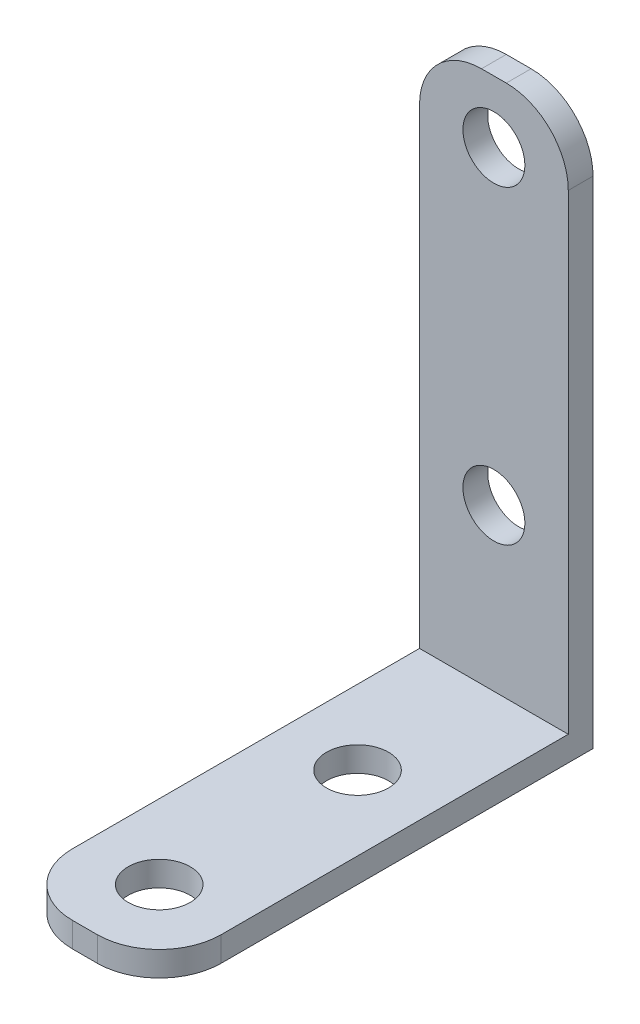
ISO-10303-21;
HEADER;
FILE_DESCRIPTION(('STEP AP214'),'2;1');
FILE_NAME('part.step','',(''),(''),'','','');
FILE_SCHEMA(('AUTOMOTIVE_DESIGN { 1 0 10303 214 1 1 1 1 }'));
ENDSEC;
DATA;
#1=APPLICATION_CONTEXT('core data for automotive mechanical design processes');
#2=APPLICATION_PROTOCOL_DEFINITION('international standard','automotive_design',2000,#1);
#3=PRODUCT_CONTEXT('',#1,'mechanical');
#4=PRODUCT('Part','Part','',(#3));
#5=PRODUCT_RELATED_PRODUCT_CATEGORY('part','',(#4));
#6=PRODUCT_DEFINITION_FORMATION('','',#4);
#7=PRODUCT_DEFINITION_CONTEXT('part definition',#1,'design');
#8=PRODUCT_DEFINITION('design','',#6,#7);
#9=PRODUCT_DEFINITION_SHAPE('','',#8);
#10=(LENGTH_UNIT() NAMED_UNIT(*) SI_UNIT(.MILLI.,.METRE.));
#11=(NAMED_UNIT(*) PLANE_ANGLE_UNIT() SI_UNIT($,.RADIAN.));
#12=(NAMED_UNIT(*) SI_UNIT($,.STERADIAN.) SOLID_ANGLE_UNIT());
#13=UNCERTAINTY_MEASURE_WITH_UNIT(LENGTH_MEASURE(1.E-05),#10,'distance_accuracy_value','');
#14=(GEOMETRIC_REPRESENTATION_CONTEXT(3) GLOBAL_UNCERTAINTY_ASSIGNED_CONTEXT((#13)) GLOBAL_UNIT_ASSIGNED_CONTEXT((#10,
#11,#12)) REPRESENTATION_CONTEXT('',''));
#15=CARTESIAN_POINT('',(0.,0.,0.));
#16=DIRECTION('',(0.,0.,1.));
#17=DIRECTION('',(1.,0.,0.));
#18=AXIS2_PLACEMENT_3D('',#15,#16,#17);
#19=CARTESIAN_POINT('',(0.,0.,2.));
#20=DIRECTION('',(0.,0.,1.));
#21=DIRECTION('',(1.,0.,0.));
#22=AXIS2_PLACEMENT_3D('',#19,#20,#21);
#23=PLANE('',#22);
#24=DIRECTION('',(-1.,0.,0.));
#25=VECTOR('',#24,1.);
#26=CARTESIAN_POINT('',(-6.,-20.5,2.));
#27=LINE('',#26,#25);
#28=CARTESIAN_POINT('',(6.,-20.5,2.));
#29=VERTEX_POINT('',#28);
#30=CARTESIAN_POINT('',(-6.,-20.5,2.));
#31=VERTEX_POINT('',#30);
#32=EDGE_CURVE('E126',#29,#31,#27,.T.);
#33=ORIENTED_EDGE('',*,*,#32,.F.);
#34=DIRECTION('',(0.,1.,0.));
#35=VECTOR('',#34,1.);
#36=CARTESIAN_POINT('',(6.,-22.5,2.));
#37=LINE('',#36,#35);
#38=CARTESIAN_POINT('',(6.,17.5,2.));
#39=VERTEX_POINT('',#38);
#40=EDGE_CURVE('E131',#29,#39,#37,.T.);
#41=ORIENTED_EDGE('',*,*,#40,.T.);
#42=CARTESIAN_POINT('',(1.,17.5,2.));
#43=DIRECTION('',(0.,0.,1.));
#44=DIRECTION('',(1.,0.,0.));
#45=AXIS2_PLACEMENT_3D('',#42,#43,#44);
#46=CIRCLE('',#45,5.);
#47=CARTESIAN_POINT('',(1.,22.5,2.));
#48=VERTEX_POINT('',#47);
#49=EDGE_CURVE('E189',#39,#48,#46,.T.);
#50=ORIENTED_EDGE('',*,*,#49,.T.);
#51=DIRECTION('',(-1.,0.,0.));
#52=VECTOR('',#51,1.);
#53=CARTESIAN_POINT('',(6.,22.5,2.));
#54=LINE('',#53,#52);
#55=CARTESIAN_POINT('',(-0.999999999999999,22.5,2.));
#56=VERTEX_POINT('',#55);
#57=EDGE_CURVE('E160',#48,#56,#54,.T.);
#58=ORIENTED_EDGE('',*,*,#57,.T.);
#59=CARTESIAN_POINT('',(-0.999999999999999,17.5,2.));
#60=DIRECTION('',(0.,0.,1.));
#61=DIRECTION('',(1.,0.,0.));
#62=AXIS2_PLACEMENT_3D('',#59,#60,#61);
#63=CIRCLE('',#62,5.);
#64=CARTESIAN_POINT('',(-6.,17.5,2.));
#65=VERTEX_POINT('',#64);
#66=EDGE_CURVE('E130',#56,#65,#63,.T.);
#67=ORIENTED_EDGE('',*,*,#66,.T.);
#68=DIRECTION('',(0.,-1.,0.));
#69=VECTOR('',#68,1.);
#70=CARTESIAN_POINT('',(-6.,-22.5,2.));
#71=LINE('',#70,#69);
#72=EDGE_CURVE('E116',#65,#31,#71,.T.);
#73=ORIENTED_EDGE('',*,*,#72,.T.);
#74=EDGE_LOOP('',(#33,#41,#50,#58,#67,#73));
#75=FACE_BOUND('',#74,.T.);
#76=CARTESIAN_POINT('',(0.,-7.50000000000001,2.));
#77=DIRECTION('',(0.,0.,1.));
#78=DIRECTION('',(1.,0.,0.));
#79=AXIS2_PLACEMENT_3D('',#76,#77,#78);
#80=CIRCLE('',#79,2.5);
#81=CARTESIAN_POINT('',(2.5,-7.50000000000001,2.));
#82=VERTEX_POINT('',#81);
#83=EDGE_CURVE('E153',#82,#82,#80,.T.);
#84=ORIENTED_EDGE('',*,*,#83,.F.);
#85=EDGE_LOOP('',(#84));
#86=FACE_BOUND('',#85,.T.);
#87=CARTESIAN_POINT('',(0.,17.5,2.));
#88=DIRECTION('',(0.,0.,1.));
#89=DIRECTION('',(1.,0.,0.));
#90=AXIS2_PLACEMENT_3D('',#87,#88,#89);
#91=CIRCLE('',#90,2.5);
#92=CARTESIAN_POINT('',(2.5,17.5,2.));
#93=VERTEX_POINT('',#92);
#94=EDGE_CURVE('E147',#93,#93,#91,.T.);
#95=ORIENTED_EDGE('',*,*,#94,.F.);
#96=EDGE_LOOP('',(#95));
#97=FACE_BOUND('',#96,.T.);
#98=ADVANCED_FACE('F37',(#75,#86,#97),#23,.T.);
#99=CARTESIAN_POINT('',(0.,0.,0.));
#100=DIRECTION('',(0.,0.,1.));
#101=DIRECTION('',(1.,0.,0.));
#102=AXIS2_PLACEMENT_3D('',#99,#100,#101);
#103=PLANE('',#102);
#104=DIRECTION('',(-1.,0.,0.));
#105=VECTOR('',#104,1.);
#106=CARTESIAN_POINT('',(6.,22.5,0.));
#107=LINE('',#106,#105);
#108=CARTESIAN_POINT('',(1.,22.5,0.));
#109=VERTEX_POINT('',#108);
#110=CARTESIAN_POINT('',(-0.999999999999999,22.5,0.));
#111=VERTEX_POINT('',#110);
#112=EDGE_CURVE('E132',#109,#111,#107,.T.);
#113=ORIENTED_EDGE('',*,*,#112,.F.);
#114=CARTESIAN_POINT('',(1.,17.5,0.));
#115=DIRECTION('',(0.,0.,1.));
#116=DIRECTION('',(1.,0.,0.));
#117=AXIS2_PLACEMENT_3D('',#114,#115,#116);
#118=CIRCLE('',#117,5.);
#119=CARTESIAN_POINT('',(6.,17.5,0.));
#120=VERTEX_POINT('',#119);
#121=EDGE_CURVE('E183',#109,#120,#118,.F.);
#122=ORIENTED_EDGE('',*,*,#121,.T.);
#123=DIRECTION('',(0.,1.,0.));
#124=VECTOR('',#123,1.);
#125=CARTESIAN_POINT('',(6.,-22.5,0.));
#126=LINE('',#125,#124);
#127=CARTESIAN_POINT('',(6.,-22.5,0.));
#128=VERTEX_POINT('',#127);
#129=EDGE_CURVE('E168',#128,#120,#126,.T.);
#130=ORIENTED_EDGE('',*,*,#129,.F.);
#131=DIRECTION('',(1.,0.,0.));
#132=VECTOR('',#131,1.);
#133=CARTESIAN_POINT('',(6.,-22.5,0.));
#134=LINE('',#133,#132);
#135=CARTESIAN_POINT('',(-6.,-22.5,0.));
#136=VERTEX_POINT('',#135);
#137=EDGE_CURVE('E165',#136,#128,#134,.T.);
#138=ORIENTED_EDGE('',*,*,#137,.F.);
#139=DIRECTION('',(0.,-1.,0.));
#140=VECTOR('',#139,1.);
#141=CARTESIAN_POINT('',(-6.,-22.5,0.));
#142=LINE('',#141,#140);
#143=CARTESIAN_POINT('',(-6.,17.5,0.));
#144=VERTEX_POINT('',#143);
#145=EDGE_CURVE('E156',#144,#136,#142,.T.);
#146=ORIENTED_EDGE('',*,*,#145,.F.);
#147=CARTESIAN_POINT('',(-0.999999999999999,17.5,0.));
#148=DIRECTION('',(0.,0.,1.));
#149=DIRECTION('',(1.,0.,0.));
#150=AXIS2_PLACEMENT_3D('',#147,#148,#149);
#151=CIRCLE('',#150,5.);
#152=EDGE_CURVE('E181',#144,#111,#151,.F.);
#153=ORIENTED_EDGE('',*,*,#152,.T.);
#154=EDGE_LOOP('',(#113,#122,#130,#138,#146,#153));
#155=FACE_BOUND('',#154,.T.);
#156=CARTESIAN_POINT('',(0.,-7.50000000000001,0.));
#157=DIRECTION('',(0.,0.,1.));
#158=DIRECTION('',(1.,0.,0.));
#159=AXIS2_PLACEMENT_3D('',#156,#157,#158);
#160=CIRCLE('',#159,2.5);
#161=CARTESIAN_POINT('',(2.5,-7.50000000000001,0.));
#162=VERTEX_POINT('',#161);
#163=EDGE_CURVE('E150',#162,#162,#160,.T.);
#164=ORIENTED_EDGE('',*,*,#163,.T.);
#165=EDGE_LOOP('',(#164));
#166=FACE_BOUND('',#165,.T.);
#167=CARTESIAN_POINT('',(0.,17.5,0.));
#168=DIRECTION('',(0.,0.,1.));
#169=DIRECTION('',(1.,0.,0.));
#170=AXIS2_PLACEMENT_3D('',#167,#168,#169);
#171=CIRCLE('',#170,2.5);
#172=CARTESIAN_POINT('',(2.5,17.5,0.));
#173=VERTEX_POINT('',#172);
#174=EDGE_CURVE('E146',#173,#173,#171,.T.);
#175=ORIENTED_EDGE('',*,*,#174,.T.);
#176=EDGE_LOOP('',(#175));
#177=FACE_BOUND('',#176,.T.);
#178=ADVANCED_FACE('F219',(#155,#166,#177),#103,.F.);
#179=CARTESIAN_POINT('',(-6.,-22.5,2.));
#180=DIRECTION('',(1.,0.,0.));
#181=DIRECTION('',(0.,0.,-1.));
#182=AXIS2_PLACEMENT_3D('',#179,#180,#181);
#183=PLANE('',#182);
#184=DIRECTION('',(0.,0.,-1.));
#185=VECTOR('',#184,1.);
#186=CARTESIAN_POINT('',(-6.,-22.5,2.));
#187=LINE('',#186,#185);
#188=CARTESIAN_POINT('',(-6.,-22.5,30.));
#189=VERTEX_POINT('',#188);
#190=EDGE_CURVE('E174',#189,#136,#187,.T.);
#191=ORIENTED_EDGE('',*,*,#190,.F.);
#192=DIRECTION('',(0.,-1.,0.));
#193=VECTOR('',#192,1.);
#194=CARTESIAN_POINT('',(-6.,-22.5,30.));
#195=LINE('',#194,#193);
#196=CARTESIAN_POINT('',(-6.,-20.5,30.));
#197=VERTEX_POINT('',#196);
#198=EDGE_CURVE('E60',#189,#197,#195,.F.);
#199=ORIENTED_EDGE('',*,*,#198,.T.);
#200=DIRECTION('',(0.,0.,-1.));
#201=VECTOR('',#200,1.);
#202=CARTESIAN_POINT('',(-6.,-20.5,35.));
#203=LINE('',#202,#201);
#204=EDGE_CURVE('E112',#197,#31,#203,.T.);
#205=ORIENTED_EDGE('',*,*,#204,.T.);
#206=ORIENTED_EDGE('',*,*,#72,.F.);
#207=DIRECTION('',(0.,0.,-1.));
#208=VECTOR('',#207,1.);
#209=CARTESIAN_POINT('',(-6.,17.5,2.));
#210=LINE('',#209,#208);
#211=EDGE_CURVE('E191',#65,#144,#210,.T.);
#212=ORIENTED_EDGE('',*,*,#211,.T.);
#213=ORIENTED_EDGE('',*,*,#145,.T.);
#214=EDGE_LOOP('',(#191,#199,#205,#206,#212,#213));
#215=FACE_BOUND('',#214,.T.);
#216=ADVANCED_FACE('F114',(#215),#183,.F.);
#217=CARTESIAN_POINT('',(6.,-22.5,2.));
#218=DIRECTION('',(0.,1.,0.));
#219=DIRECTION('',(0.,0.,1.));
#220=AXIS2_PLACEMENT_3D('',#217,#218,#219);
#221=PLANE('',#220);
#222=CARTESIAN_POINT('',(0.,-22.5,13.));
#223=DIRECTION('',(0.,1.,0.));
#224=DIRECTION('',(0.,0.,1.));
#225=AXIS2_PLACEMENT_3D('',#222,#223,#224);
#226=CIRCLE('',#225,2.5);
#227=CARTESIAN_POINT('',(0.,-22.5,15.5));
#228=VERTEX_POINT('',#227);
#229=EDGE_CURVE('E136',#228,#228,#226,.T.);
#230=ORIENTED_EDGE('',*,*,#229,.T.);
#231=EDGE_LOOP('',(#230));
#232=FACE_BOUND('',#231,.T.);
#233=CARTESIAN_POINT('',(0.,-22.5,29.));
#234=DIRECTION('',(0.,1.,0.));
#235=DIRECTION('',(0.,0.,1.));
#236=AXIS2_PLACEMENT_3D('',#233,#234,#235);
#237=CIRCLE('',#236,2.5);
#238=CARTESIAN_POINT('',(0.,-22.5,31.5));
#239=VERTEX_POINT('',#238);
#240=EDGE_CURVE('E141',#239,#239,#237,.T.);
#241=ORIENTED_EDGE('',*,*,#240,.T.);
#242=EDGE_LOOP('',(#241));
#243=FACE_BOUND('',#242,.T.);
#244=DIRECTION('',(1.,0.,0.));
#245=VECTOR('',#244,1.);
#246=CARTESIAN_POINT('',(-6.,-22.5,35.));
#247=LINE('',#246,#245);
#248=CARTESIAN_POINT('',(-0.999999999999999,-22.5,35.));
#249=VERTEX_POINT('',#248);
#250=CARTESIAN_POINT('',(1.,-22.5,35.));
#251=VERTEX_POINT('',#250);
#252=EDGE_CURVE('E135',#249,#251,#247,.T.);
#253=ORIENTED_EDGE('',*,*,#252,.F.);
#254=CARTESIAN_POINT('',(-0.999999999999999,-22.5,30.));
#255=DIRECTION('',(0.,1.,0.));
#256=DIRECTION('',(0.,0.,1.));
#257=AXIS2_PLACEMENT_3D('',#254,#255,#256);
#258=CIRCLE('',#257,5.);
#259=EDGE_CURVE('E201',#249,#189,#258,.F.);
#260=ORIENTED_EDGE('',*,*,#259,.T.);
#261=ORIENTED_EDGE('',*,*,#190,.T.);
#262=ORIENTED_EDGE('',*,*,#137,.T.);
#263=DIRECTION('',(0.,0.,-1.));
#264=VECTOR('',#263,1.);
#265=CARTESIAN_POINT('',(6.,-22.5,2.));
#266=LINE('',#265,#264);
#267=CARTESIAN_POINT('',(6.,-22.5,30.));
#268=VERTEX_POINT('',#267);
#269=EDGE_CURVE('E162',#268,#128,#266,.T.);
#270=ORIENTED_EDGE('',*,*,#269,.F.);
#271=CARTESIAN_POINT('',(1.,-22.5,30.));
#272=DIRECTION('',(0.,1.,0.));
#273=DIRECTION('',(0.,0.,1.));
#274=AXIS2_PLACEMENT_3D('',#271,#272,#273);
#275=CIRCLE('',#274,5.);
#276=EDGE_CURVE('E199',#268,#251,#275,.F.);
#277=ORIENTED_EDGE('',*,*,#276,.T.);
#278=EDGE_LOOP('',(#253,#260,#261,#262,#270,#277));
#279=FACE_BOUND('',#278,.T.);
#280=ADVANCED_FACE('F213',(#232,#243,#279),#221,.F.);
#281=CARTESIAN_POINT('',(6.,-22.5,2.));
#282=DIRECTION('',(-1.,0.,0.));
#283=DIRECTION('',(0.,0.,1.));
#284=AXIS2_PLACEMENT_3D('',#281,#282,#283);
#285=PLANE('',#284);
#286=DIRECTION('',(0.,0.,-1.));
#287=VECTOR('',#286,1.);
#288=CARTESIAN_POINT('',(6.,-20.5,35.));
#289=LINE('',#288,#287);
#290=CARTESIAN_POINT('',(6.,-20.5,30.));
#291=VERTEX_POINT('',#290);
#292=EDGE_CURVE('E120',#291,#29,#289,.T.);
#293=ORIENTED_EDGE('',*,*,#292,.F.);
#294=DIRECTION('',(0.,1.,0.));
#295=VECTOR('',#294,1.);
#296=CARTESIAN_POINT('',(6.,-22.5,30.));
#297=LINE('',#296,#295);
#298=EDGE_CURVE('E11',#291,#268,#297,.F.);
#299=ORIENTED_EDGE('',*,*,#298,.T.);
#300=ORIENTED_EDGE('',*,*,#269,.T.);
#301=ORIENTED_EDGE('',*,*,#129,.T.);
#302=DIRECTION('',(0.,0.,-1.));
#303=VECTOR('',#302,1.);
#304=CARTESIAN_POINT('',(6.,17.5,2.));
#305=LINE('',#304,#303);
#306=EDGE_CURVE('E185',#120,#39,#305,.F.);
#307=ORIENTED_EDGE('',*,*,#306,.T.);
#308=ORIENTED_EDGE('',*,*,#40,.F.);
#309=EDGE_LOOP('',(#293,#299,#300,#301,#307,#308));
#310=FACE_BOUND('',#309,.T.);
#311=ADVANCED_FACE('F226',(#310),#285,.F.);
#312=CARTESIAN_POINT('',(6.,22.5,2.));
#313=DIRECTION('',(0.,-1.,0.));
#314=DIRECTION('',(0.,0.,-1.));
#315=AXIS2_PLACEMENT_3D('',#312,#313,#314);
#316=PLANE('',#315);
#317=ORIENTED_EDGE('',*,*,#57,.F.);
#318=DIRECTION('',(0.,0.,-1.));
#319=VECTOR('',#318,1.);
#320=CARTESIAN_POINT('',(1.,22.5,2.));
#321=LINE('',#320,#319);
#322=EDGE_CURVE('E178',#48,#109,#321,.T.);
#323=ORIENTED_EDGE('',*,*,#322,.T.);
#324=ORIENTED_EDGE('',*,*,#112,.T.);
#325=DIRECTION('',(0.,0.,-1.));
#326=VECTOR('',#325,1.);
#327=CARTESIAN_POINT('',(-0.999999999999999,22.5,2.));
#328=LINE('',#327,#326);
#329=EDGE_CURVE('E176',#111,#56,#328,.F.);
#330=ORIENTED_EDGE('',*,*,#329,.T.);
#331=EDGE_LOOP('',(#317,#323,#324,#330));
#332=FACE_BOUND('',#331,.T.);
#333=ADVANCED_FACE('F233',(#332),#316,.F.);
#334=CARTESIAN_POINT('',(0.,-7.50000000000001,2.));
#335=DIRECTION('',(0.,0.,-1.));
#336=DIRECTION('',(-1.,0.,0.));
#337=AXIS2_PLACEMENT_3D('',#334,#335,#336);
#338=CYLINDRICAL_SURFACE('',#337,2.5);
#339=ORIENTED_EDGE('',*,*,#83,.T.);
#340=EDGE_LOOP('',(#339));
#341=FACE_BOUND('',#340,.T.);
#342=ORIENTED_EDGE('',*,*,#163,.F.);
#343=EDGE_LOOP('',(#342));
#344=FACE_BOUND('',#343,.T.);
#345=ADVANCED_FACE('F255',(#341,#344),#338,.F.);
#346=CARTESIAN_POINT('',(0.,17.5,2.));
#347=DIRECTION('',(0.,0.,-1.));
#348=DIRECTION('',(-1.,0.,0.));
#349=AXIS2_PLACEMENT_3D('',#346,#347,#348);
#350=CYLINDRICAL_SURFACE('',#349,2.5);
#351=ORIENTED_EDGE('',*,*,#94,.T.);
#352=EDGE_LOOP('',(#351));
#353=FACE_BOUND('',#352,.T.);
#354=ORIENTED_EDGE('',*,*,#174,.F.);
#355=EDGE_LOOP('',(#354));
#356=FACE_BOUND('',#355,.T.);
#357=ADVANCED_FACE('F246',(#353,#356),#350,.F.);
#358=CARTESIAN_POINT('',(1.,17.5,2.));
#359=DIRECTION('',(0.,0.,-1.));
#360=DIRECTION('',(-1.,0.,0.));
#361=AXIS2_PLACEMENT_3D('',#358,#359,#360);
#362=CYLINDRICAL_SURFACE('',#361,5.);
#363=ORIENTED_EDGE('',*,*,#49,.F.);
#364=ORIENTED_EDGE('',*,*,#306,.F.);
#365=ORIENTED_EDGE('',*,*,#121,.F.);
#366=ORIENTED_EDGE('',*,*,#322,.F.);
#367=EDGE_LOOP('',(#363,#364,#365,#366));
#368=FACE_BOUND('',#367,.T.);
#369=ADVANCED_FACE('F235',(#368),#362,.T.);
#370=CARTESIAN_POINT('',(-0.999999999999999,17.5,2.));
#371=DIRECTION('',(0.,0.,-1.));
#372=DIRECTION('',(-1.,0.,0.));
#373=AXIS2_PLACEMENT_3D('',#370,#371,#372);
#374=CYLINDRICAL_SURFACE('',#373,5.);
#375=ORIENTED_EDGE('',*,*,#66,.F.);
#376=ORIENTED_EDGE('',*,*,#329,.F.);
#377=ORIENTED_EDGE('',*,*,#152,.F.);
#378=ORIENTED_EDGE('',*,*,#211,.F.);
#379=EDGE_LOOP('',(#375,#376,#377,#378));
#380=FACE_BOUND('',#379,.T.);
#381=ADVANCED_FACE('F237',(#380),#374,.T.);
#382=CARTESIAN_POINT('',(-6.,-20.5,35.));
#383=DIRECTION('',(0.,-1.,0.));
#384=DIRECTION('',(0.,0.,-1.));
#385=AXIS2_PLACEMENT_3D('',#382,#383,#384);
#386=PLANE('',#385);
#387=CARTESIAN_POINT('',(0.,-20.5,13.));
#388=DIRECTION('',(0.,1.,0.));
#389=DIRECTION('',(0.,0.,1.));
#390=AXIS2_PLACEMENT_3D('',#387,#388,#389);
#391=CIRCLE('',#390,2.5);
#392=CARTESIAN_POINT('',(0.,-20.5,15.5));
#393=VERTEX_POINT('',#392);
#394=EDGE_CURVE('E386',#393,#393,#391,.T.);
#395=ORIENTED_EDGE('',*,*,#394,.F.);
#396=EDGE_LOOP('',(#395));
#397=FACE_BOUND('',#396,.T.);
#398=CARTESIAN_POINT('',(0.,-20.5,29.));
#399=DIRECTION('',(0.,1.,0.));
#400=DIRECTION('',(0.,0.,1.));
#401=AXIS2_PLACEMENT_3D('',#398,#399,#400);
#402=CIRCLE('',#401,2.5);
#403=CARTESIAN_POINT('',(0.,-20.5,31.5));
#404=VERTEX_POINT('',#403);
#405=EDGE_CURVE('E393',#404,#404,#402,.T.);
#406=ORIENTED_EDGE('',*,*,#405,.F.);
#407=EDGE_LOOP('',(#406));
#408=FACE_BOUND('',#407,.T.);
#409=ORIENTED_EDGE('',*,*,#204,.F.);
#410=CARTESIAN_POINT('',(-0.999999999999999,-20.5,30.));
#411=DIRECTION('',(0.,-1.,0.));
#412=DIRECTION('',(0.,0.,-1.));
#413=AXIS2_PLACEMENT_3D('',#410,#411,#412);
#414=CIRCLE('',#413,5.);
#415=CARTESIAN_POINT('',(-0.999999999999999,-20.5,35.));
#416=VERTEX_POINT('',#415);
#417=EDGE_CURVE('E45',#197,#416,#414,.F.);
#418=ORIENTED_EDGE('',*,*,#417,.T.);
#419=DIRECTION('',(-1.,0.,0.));
#420=VECTOR('',#419,1.);
#421=CARTESIAN_POINT('',(-6.,-20.5,35.));
#422=LINE('',#421,#420);
#423=CARTESIAN_POINT('',(1.,-20.5,35.));
#424=VERTEX_POINT('',#423);
#425=EDGE_CURVE('E121',#424,#416,#422,.T.);
#426=ORIENTED_EDGE('',*,*,#425,.F.);
#427=CARTESIAN_POINT('',(1.,-20.5,30.));
#428=DIRECTION('',(0.,-1.,0.));
#429=DIRECTION('',(0.,0.,-1.));
#430=AXIS2_PLACEMENT_3D('',#427,#428,#429);
#431=CIRCLE('',#430,5.);
#432=EDGE_CURVE('E52',#424,#291,#431,.F.);
#433=ORIENTED_EDGE('',*,*,#432,.T.);
#434=ORIENTED_EDGE('',*,*,#292,.T.);
#435=ORIENTED_EDGE('',*,*,#32,.T.);
#436=EDGE_LOOP('',(#409,#418,#426,#433,#434,#435));
#437=FACE_BOUND('',#436,.T.);
#438=ADVANCED_FACE('F134',(#397,#408,#437),#386,.F.);
#439=CARTESIAN_POINT('',(0.,0.,35.));
#440=DIRECTION('',(0.,0.,-1.));
#441=DIRECTION('',(-1.,0.,0.));
#442=AXIS2_PLACEMENT_3D('',#439,#440,#441);
#443=PLANE('',#442);
#444=ORIENTED_EDGE('',*,*,#425,.T.);
#445=DIRECTION('',(0.,-1.,0.));
#446=VECTOR('',#445,1.);
#447=CARTESIAN_POINT('',(-0.999999999999999,0.,35.));
#448=LINE('',#447,#446);
#449=EDGE_CURVE('E196',#416,#249,#448,.T.);
#450=ORIENTED_EDGE('',*,*,#449,.T.);
#451=ORIENTED_EDGE('',*,*,#252,.T.);
#452=DIRECTION('',(0.,1.,0.));
#453=VECTOR('',#452,1.);
#454=CARTESIAN_POINT('',(1.,0.,35.));
#455=LINE('',#454,#453);
#456=EDGE_CURVE('E193',#251,#424,#455,.T.);
#457=ORIENTED_EDGE('',*,*,#456,.T.);
#458=EDGE_LOOP('',(#444,#450,#451,#457));
#459=FACE_BOUND('',#458,.T.);
#460=ADVANCED_FACE('F208',(#459),#443,.F.);
#461=CARTESIAN_POINT('',(0.,-53.5,29.));
#462=DIRECTION('',(0.,1.,0.));
#463=DIRECTION('',(0.,0.,1.));
#464=AXIS2_PLACEMENT_3D('',#461,#462,#463);
#465=CYLINDRICAL_SURFACE('',#464,2.5);
#466=ORIENTED_EDGE('',*,*,#405,.T.);
#467=EDGE_LOOP('',(#466));
#468=FACE_BOUND('',#467,.T.);
#469=ORIENTED_EDGE('',*,*,#240,.F.);
#470=EDGE_LOOP('',(#469));
#471=FACE_BOUND('',#470,.T.);
#472=ADVANCED_FACE('F314',(#468,#471),#465,.F.);
#473=CARTESIAN_POINT('',(0.,-53.5,13.));
#474=DIRECTION('',(0.,1.,0.));
#475=DIRECTION('',(0.,0.,1.));
#476=AXIS2_PLACEMENT_3D('',#473,#474,#475);
#477=CYLINDRICAL_SURFACE('',#476,2.5);
#478=ORIENTED_EDGE('',*,*,#394,.T.);
#479=EDGE_LOOP('',(#478));
#480=FACE_BOUND('',#479,.T.);
#481=ORIENTED_EDGE('',*,*,#229,.F.);
#482=EDGE_LOOP('',(#481));
#483=FACE_BOUND('',#482,.T.);
#484=ADVANCED_FACE('F318',(#480,#483),#477,.F.);
#485=CARTESIAN_POINT('',(-0.999999999999999,0.,30.));
#486=DIRECTION('',(0.,-1.,0.));
#487=DIRECTION('',(0.,0.,-1.));
#488=AXIS2_PLACEMENT_3D('',#485,#486,#487);
#489=CYLINDRICAL_SURFACE('',#488,5.);
#490=ORIENTED_EDGE('',*,*,#417,.F.);
#491=ORIENTED_EDGE('',*,*,#198,.F.);
#492=ORIENTED_EDGE('',*,*,#259,.F.);
#493=ORIENTED_EDGE('',*,*,#449,.F.);
#494=EDGE_LOOP('',(#490,#491,#492,#493));
#495=FACE_BOUND('',#494,.T.);
#496=ADVANCED_FACE('F211',(#495),#489,.T.);
#497=CARTESIAN_POINT('',(1.,0.,30.));
#498=DIRECTION('',(0.,1.,0.));
#499=DIRECTION('',(0.,0.,1.));
#500=AXIS2_PLACEMENT_3D('',#497,#498,#499);
#501=CYLINDRICAL_SURFACE('',#500,5.);
#502=ORIENTED_EDGE('',*,*,#276,.F.);
#503=ORIENTED_EDGE('',*,*,#298,.F.);
#504=ORIENTED_EDGE('',*,*,#432,.F.);
#505=ORIENTED_EDGE('',*,*,#456,.F.);
#506=EDGE_LOOP('',(#502,#503,#504,#505));
#507=FACE_BOUND('',#506,.T.);
#508=ADVANCED_FACE('F39',(#507),#501,.T.);
#509=CLOSED_SHELL('',(#98,#178,#216,#280,#311,#333,#345,#357,#369,#381,#438,#460,#472,#484,#496,#508));
#510=MANIFOLD_SOLID_BREP('B2',#509);
#511=ADVANCED_BREP_SHAPE_REPRESENTATION('',(#18,#510),#14);
#512=SHAPE_DEFINITION_REPRESENTATION(#9,#511);
ENDSEC;
END-ISO-10303-21;
